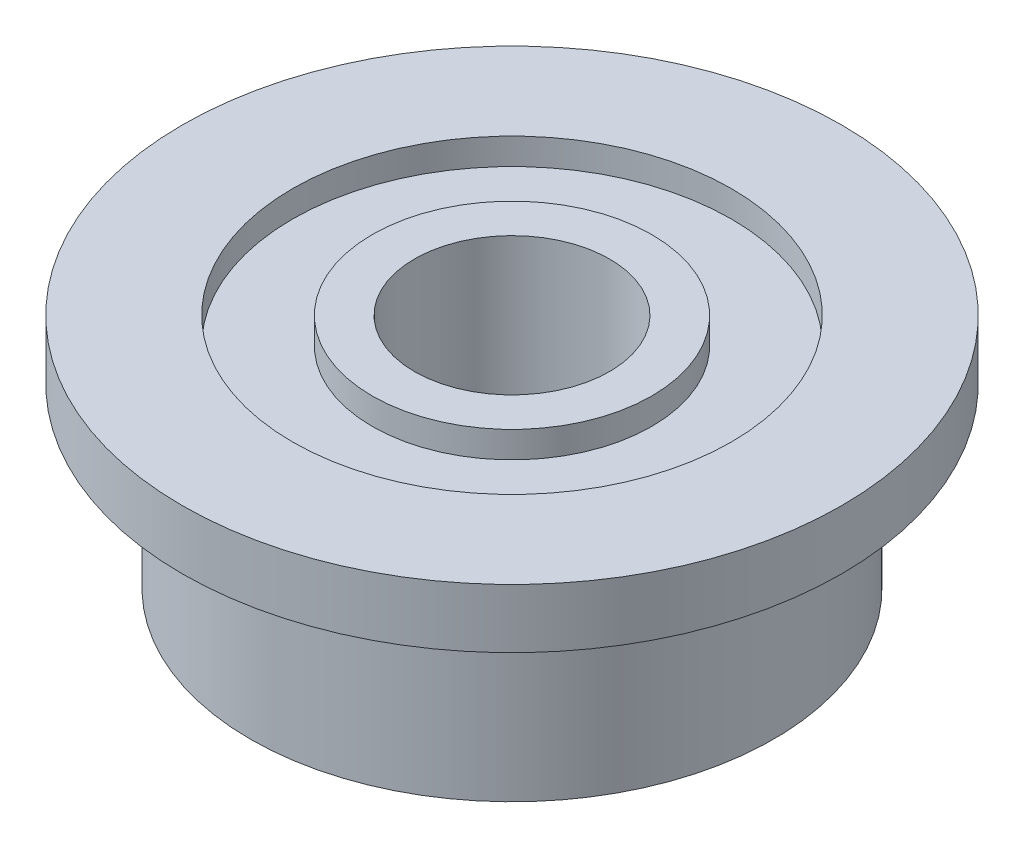
ISO-10303-21;
HEADER;
FILE_DESCRIPTION(('STEP AP214'),'2;1');
FILE_NAME('part.step','',(''),(''),'','','');
FILE_SCHEMA(('AUTOMOTIVE_DESIGN { 1 0 10303 214 1 1 1 1 }'));
ENDSEC;
DATA;
#1=APPLICATION_CONTEXT('core data for automotive mechanical design processes');
#2=APPLICATION_PROTOCOL_DEFINITION('international standard','automotive_design',2000,#1);
#3=PRODUCT_CONTEXT('',#1,'mechanical');
#4=PRODUCT('Part','Part','',(#3));
#5=PRODUCT_RELATED_PRODUCT_CATEGORY('part','',(#4));
#6=PRODUCT_DEFINITION_FORMATION('','',#4);
#7=PRODUCT_DEFINITION_CONTEXT('part definition',#1,'design');
#8=PRODUCT_DEFINITION('design','',#6,#7);
#9=PRODUCT_DEFINITION_SHAPE('','',#8);
#10=(LENGTH_UNIT() NAMED_UNIT(*) SI_UNIT(.MILLI.,.METRE.));
#11=(NAMED_UNIT(*) PLANE_ANGLE_UNIT() SI_UNIT($,.RADIAN.));
#12=(NAMED_UNIT(*) SI_UNIT($,.STERADIAN.) SOLID_ANGLE_UNIT());
#13=UNCERTAINTY_MEASURE_WITH_UNIT(LENGTH_MEASURE(1.E-05),#10,'distance_accuracy_value','');
#14=(GEOMETRIC_REPRESENTATION_CONTEXT(3) GLOBAL_UNCERTAINTY_ASSIGNED_CONTEXT((#13)) GLOBAL_UNIT_ASSIGNED_CONTEXT((#10,
#11,#12)) REPRESENTATION_CONTEXT('',''));
#15=CARTESIAN_POINT('',(0.,0.,0.));
#16=DIRECTION('',(0.,0.,1.));
#17=DIRECTION('',(1.,0.,0.));
#18=AXIS2_PLACEMENT_3D('',#15,#16,#17);
#19=CARTESIAN_POINT('',(0.,0.,0.));
#20=DIRECTION('',(0.,1.,0.));
#21=DIRECTION('',(0.,0.,1.));
#22=AXIS2_PLACEMENT_3D('',#19,#20,#21);
#23=CYLINDRICAL_SURFACE('',#22,1.325);
#24=CARTESIAN_POINT('',(0.,0.,0.));
#25=DIRECTION('',(0.,1.,0.));
#26=DIRECTION('',(0.,0.,1.));
#27=AXIS2_PLACEMENT_3D('',#24,#25,#26);
#28=CIRCLE('',#27,1.325);
#29=CARTESIAN_POINT('',(0.,0.,1.325));
#30=VERTEX_POINT('',#29);
#31=EDGE_CURVE('E10',#30,#30,#28,.T.);
#32=ORIENTED_EDGE('',*,*,#31,.F.);
#33=EDGE_LOOP('',(#32));
#34=FACE_BOUND('',#33,.T.);
#35=CARTESIAN_POINT('',(0.,-0.25,0.));
#36=DIRECTION('',(0.,1.,0.));
#37=DIRECTION('',(0.,0.,1.));
#38=AXIS2_PLACEMENT_3D('',#35,#36,#37);
#39=CIRCLE('',#38,1.325);
#40=CARTESIAN_POINT('',(0.,-0.25,1.325));
#41=VERTEX_POINT('',#40);
#42=EDGE_CURVE('E78',#41,#41,#39,.T.);
#43=ORIENTED_EDGE('',*,*,#42,.T.);
#44=EDGE_LOOP('',(#43));
#45=FACE_BOUND('',#44,.T.);
#46=ADVANCED_FACE('F32',(#34,#45),#23,.T.);
#47=CARTESIAN_POINT('',(1.325,0.,0.));
#48=DIRECTION('',(0.,-1.,0.));
#49=DIRECTION('',(0.,0.,-1.));
#50=AXIS2_PLACEMENT_3D('',#47,#48,#49);
#51=PLANE('',#50);
#52=CARTESIAN_POINT('',(0.,0.,0.));
#53=DIRECTION('',(0.,1.,0.));
#54=DIRECTION('',(0.,0.,1.));
#55=AXIS2_PLACEMENT_3D('',#52,#53,#54);
#56=CIRCLE('',#55,0.925);
#57=CARTESIAN_POINT('',(0.,0.,0.925));
#58=VERTEX_POINT('',#57);
#59=EDGE_CURVE('E38',#58,#58,#56,.T.);
#60=ORIENTED_EDGE('',*,*,#59,.F.);
#61=EDGE_LOOP('',(#60));
#62=FACE_BOUND('',#61,.T.);
#63=ORIENTED_EDGE('',*,*,#31,.T.);
#64=EDGE_LOOP('',(#63));
#65=FACE_BOUND('',#64,.T.);
#66=ADVANCED_FACE('F151',(#62,#65),#51,.F.);
#67=CARTESIAN_POINT('',(0.,0.,0.));
#68=DIRECTION('',(0.,1.,0.));
#69=DIRECTION('',(0.,0.,1.));
#70=AXIS2_PLACEMENT_3D('',#67,#68,#69);
#71=CYLINDRICAL_SURFACE('',#70,0.925);
#72=CARTESIAN_POINT('',(0.,-2.24,0.));
#73=DIRECTION('',(0.,1.,0.));
#74=DIRECTION('',(0.,0.,1.));
#75=AXIS2_PLACEMENT_3D('',#72,#73,#74);
#76=CIRCLE('',#75,0.925);
#77=CARTESIAN_POINT('',(0.,-2.24,0.925));
#78=VERTEX_POINT('',#77);
#79=EDGE_CURVE('E42',#78,#78,#76,.T.);
#80=ORIENTED_EDGE('',*,*,#79,.F.);
#81=EDGE_LOOP('',(#80));
#82=FACE_BOUND('',#81,.T.);
#83=ORIENTED_EDGE('',*,*,#59,.T.);
#84=EDGE_LOOP('',(#83));
#85=FACE_BOUND('',#84,.T.);
#86=ADVANCED_FACE('F146',(#82,#85),#71,.F.);
#87=CARTESIAN_POINT('',(0.925,-2.24,0.));
#88=DIRECTION('',(0.,1.,0.));
#89=DIRECTION('',(0.,0.,1.));
#90=AXIS2_PLACEMENT_3D('',#87,#88,#89);
#91=PLANE('',#90);
#92=CARTESIAN_POINT('',(0.,-2.24,0.));
#93=DIRECTION('',(0.,1.,0.));
#94=DIRECTION('',(0.,0.,1.));
#95=AXIS2_PLACEMENT_3D('',#92,#93,#94);
#96=CIRCLE('',#95,1.325);
#97=CARTESIAN_POINT('',(0.,-2.24,1.325));
#98=VERTEX_POINT('',#97);
#99=EDGE_CURVE('E46',#98,#98,#96,.T.);
#100=ORIENTED_EDGE('',*,*,#99,.F.);
#101=EDGE_LOOP('',(#100));
#102=FACE_BOUND('',#101,.T.);
#103=ORIENTED_EDGE('',*,*,#79,.T.);
#104=EDGE_LOOP('',(#103));
#105=FACE_BOUND('',#104,.T.);
#106=ADVANCED_FACE('F140',(#102,#105),#91,.F.);
#107=CARTESIAN_POINT('',(0.,0.,0.));
#108=DIRECTION('',(0.,1.,0.));
#109=DIRECTION('',(0.,0.,1.));
#110=AXIS2_PLACEMENT_3D('',#107,#108,#109);
#111=CYLINDRICAL_SURFACE('',#110,1.325);
#112=CARTESIAN_POINT('',(0.,-1.99,0.));
#113=DIRECTION('',(0.,1.,0.));
#114=DIRECTION('',(0.,0.,1.));
#115=AXIS2_PLACEMENT_3D('',#112,#113,#114);
#116=CIRCLE('',#115,1.325);
#117=CARTESIAN_POINT('',(0.,-1.99,1.325));
#118=VERTEX_POINT('',#117);
#119=EDGE_CURVE('E51',#118,#118,#116,.T.);
#120=ORIENTED_EDGE('',*,*,#119,.F.);
#121=EDGE_LOOP('',(#120));
#122=FACE_BOUND('',#121,.T.);
#123=ORIENTED_EDGE('',*,*,#99,.T.);
#124=EDGE_LOOP('',(#123));
#125=FACE_BOUND('',#124,.T.);
#126=ADVANCED_FACE('F134',(#122,#125),#111,.T.);
#127=CARTESIAN_POINT('',(1.325,-1.99,0.));
#128=DIRECTION('',(0.,1.,0.));
#129=DIRECTION('',(0.,0.,1.));
#130=AXIS2_PLACEMENT_3D('',#127,#128,#129);
#131=PLANE('',#130);
#132=CARTESIAN_POINT('',(0.,-1.99,0.));
#133=DIRECTION('',(0.,1.,0.));
#134=DIRECTION('',(0.,0.,1.));
#135=AXIS2_PLACEMENT_3D('',#132,#133,#134);
#136=CIRCLE('',#135,2.08);
#137=CARTESIAN_POINT('',(0.,-1.99,2.08));
#138=VERTEX_POINT('',#137);
#139=EDGE_CURVE('E54',#138,#138,#136,.T.);
#140=ORIENTED_EDGE('',*,*,#139,.F.);
#141=EDGE_LOOP('',(#140));
#142=FACE_BOUND('',#141,.T.);
#143=ORIENTED_EDGE('',*,*,#119,.T.);
#144=EDGE_LOOP('',(#143));
#145=FACE_BOUND('',#144,.T.);
#146=ADVANCED_FACE('F128',(#142,#145),#131,.F.);
#147=CARTESIAN_POINT('',(0.,0.,0.));
#148=DIRECTION('',(0.,1.,0.));
#149=DIRECTION('',(0.,0.,1.));
#150=AXIS2_PLACEMENT_3D('',#147,#148,#149);
#151=CYLINDRICAL_SURFACE('',#150,2.08);
#152=CARTESIAN_POINT('',(0.,-2.24,0.));
#153=DIRECTION('',(0.,1.,0.));
#154=DIRECTION('',(0.,0.,1.));
#155=AXIS2_PLACEMENT_3D('',#152,#153,#154);
#156=CIRCLE('',#155,2.08);
#157=CARTESIAN_POINT('',(0.,-2.24,2.08));
#158=VERTEX_POINT('',#157);
#159=EDGE_CURVE('E57',#158,#158,#156,.T.);
#160=ORIENTED_EDGE('',*,*,#159,.F.);
#161=EDGE_LOOP('',(#160));
#162=FACE_BOUND('',#161,.T.);
#163=ORIENTED_EDGE('',*,*,#139,.T.);
#164=EDGE_LOOP('',(#163));
#165=FACE_BOUND('',#164,.T.);
#166=ADVANCED_FACE('F122',(#162,#165),#151,.F.);
#167=CARTESIAN_POINT('',(2.08,-2.24,0.));
#168=DIRECTION('',(0.,1.,0.));
#169=DIRECTION('',(0.,0.,1.));
#170=AXIS2_PLACEMENT_3D('',#167,#168,#169);
#171=PLANE('',#170);
#172=CARTESIAN_POINT('',(0.,-2.24,0.));
#173=DIRECTION('',(0.,1.,0.));
#174=DIRECTION('',(0.,0.,1.));
#175=AXIS2_PLACEMENT_3D('',#172,#173,#174);
#176=CIRCLE('',#175,2.48);
#177=CARTESIAN_POINT('',(0.,-2.24,2.48));
#178=VERTEX_POINT('',#177);
#179=EDGE_CURVE('E60',#178,#178,#176,.T.);
#180=ORIENTED_EDGE('',*,*,#179,.F.);
#181=EDGE_LOOP('',(#180));
#182=FACE_BOUND('',#181,.T.);
#183=ORIENTED_EDGE('',*,*,#159,.T.);
#184=EDGE_LOOP('',(#183));
#185=FACE_BOUND('',#184,.T.);
#186=ADVANCED_FACE('F116',(#182,#185),#171,.F.);
#187=CARTESIAN_POINT('',(0.,0.,0.));
#188=DIRECTION('',(0.,1.,0.));
#189=DIRECTION('',(0.,0.,1.));
#190=AXIS2_PLACEMENT_3D('',#187,#188,#189);
#191=CYLINDRICAL_SURFACE('',#190,2.48);
#192=CARTESIAN_POINT('',(0.,-0.56,0.));
#193=DIRECTION('',(0.,1.,0.));
#194=DIRECTION('',(0.,0.,1.));
#195=AXIS2_PLACEMENT_3D('',#192,#193,#194);
#196=CIRCLE('',#195,2.48);
#197=CARTESIAN_POINT('',(0.,-0.56,2.48));
#198=VERTEX_POINT('',#197);
#199=EDGE_CURVE('E63',#198,#198,#196,.T.);
#200=ORIENTED_EDGE('',*,*,#199,.F.);
#201=EDGE_LOOP('',(#200));
#202=FACE_BOUND('',#201,.T.);
#203=ORIENTED_EDGE('',*,*,#179,.T.);
#204=EDGE_LOOP('',(#203));
#205=FACE_BOUND('',#204,.T.);
#206=ADVANCED_FACE('F110',(#202,#205),#191,.T.);
#207=CARTESIAN_POINT('',(2.48,-0.56,0.));
#208=DIRECTION('',(0.,1.,0.));
#209=DIRECTION('',(0.,0.,1.));
#210=AXIS2_PLACEMENT_3D('',#207,#208,#209);
#211=PLANE('',#210);
#212=CARTESIAN_POINT('',(0.,-0.56,0.));
#213=DIRECTION('',(0.,1.,0.));
#214=DIRECTION('',(0.,0.,1.));
#215=AXIS2_PLACEMENT_3D('',#212,#213,#214);
#216=CIRCLE('',#215,3.125);
#217=CARTESIAN_POINT('',(0.,-0.56,3.125));
#218=VERTEX_POINT('',#217);
#219=EDGE_CURVE('E66',#218,#218,#216,.T.);
#220=ORIENTED_EDGE('',*,*,#219,.F.);
#221=EDGE_LOOP('',(#220));
#222=FACE_BOUND('',#221,.T.);
#223=ORIENTED_EDGE('',*,*,#199,.T.);
#224=EDGE_LOOP('',(#223));
#225=FACE_BOUND('',#224,.T.);
#226=ADVANCED_FACE('F104',(#222,#225),#211,.F.);
#227=CARTESIAN_POINT('',(0.,0.,0.));
#228=DIRECTION('',(0.,1.,0.));
#229=DIRECTION('',(0.,0.,1.));
#230=AXIS2_PLACEMENT_3D('',#227,#228,#229);
#231=CYLINDRICAL_SURFACE('',#230,3.125);
#232=CARTESIAN_POINT('',(0.,0.,0.));
#233=DIRECTION('',(0.,1.,0.));
#234=DIRECTION('',(0.,0.,1.));
#235=AXIS2_PLACEMENT_3D('',#232,#233,#234);
#236=CIRCLE('',#235,3.125);
#237=CARTESIAN_POINT('',(0.,0.,3.125));
#238=VERTEX_POINT('',#237);
#239=EDGE_CURVE('E69',#238,#238,#236,.T.);
#240=ORIENTED_EDGE('',*,*,#239,.F.);
#241=EDGE_LOOP('',(#240));
#242=FACE_BOUND('',#241,.T.);
#243=ORIENTED_EDGE('',*,*,#219,.T.);
#244=EDGE_LOOP('',(#243));
#245=FACE_BOUND('',#244,.T.);
#246=ADVANCED_FACE('F98',(#242,#245),#231,.T.);
#247=CARTESIAN_POINT('',(3.125,0.,0.));
#248=DIRECTION('',(0.,-1.,0.));
#249=DIRECTION('',(0.,0.,-1.));
#250=AXIS2_PLACEMENT_3D('',#247,#248,#249);
#251=PLANE('',#250);
#252=CARTESIAN_POINT('',(0.,0.,0.));
#253=DIRECTION('',(0.,1.,0.));
#254=DIRECTION('',(0.,0.,1.));
#255=AXIS2_PLACEMENT_3D('',#252,#253,#254);
#256=CIRCLE('',#255,2.08);
#257=CARTESIAN_POINT('',(0.,0.,2.08));
#258=VERTEX_POINT('',#257);
#259=EDGE_CURVE('E72',#258,#258,#256,.T.);
#260=ORIENTED_EDGE('',*,*,#259,.F.);
#261=EDGE_LOOP('',(#260));
#262=FACE_BOUND('',#261,.T.);
#263=ORIENTED_EDGE('',*,*,#239,.T.);
#264=EDGE_LOOP('',(#263));
#265=FACE_BOUND('',#264,.T.);
#266=ADVANCED_FACE('F92',(#262,#265),#251,.F.);
#267=CARTESIAN_POINT('',(0.,0.,0.));
#268=DIRECTION('',(0.,1.,0.));
#269=DIRECTION('',(0.,0.,1.));
#270=AXIS2_PLACEMENT_3D('',#267,#268,#269);
#271=CYLINDRICAL_SURFACE('',#270,2.08);
#272=CARTESIAN_POINT('',(0.,-0.25,0.));
#273=DIRECTION('',(0.,1.,0.));
#274=DIRECTION('',(0.,0.,1.));
#275=AXIS2_PLACEMENT_3D('',#272,#273,#274);
#276=CIRCLE('',#275,2.08);
#277=CARTESIAN_POINT('',(0.,-0.25,2.08));
#278=VERTEX_POINT('',#277);
#279=EDGE_CURVE('E75',#278,#278,#276,.T.);
#280=ORIENTED_EDGE('',*,*,#279,.F.);
#281=EDGE_LOOP('',(#280));
#282=FACE_BOUND('',#281,.T.);
#283=ORIENTED_EDGE('',*,*,#259,.T.);
#284=EDGE_LOOP('',(#283));
#285=FACE_BOUND('',#284,.T.);
#286=ADVANCED_FACE('F86',(#282,#285),#271,.F.);
#287=CARTESIAN_POINT('',(2.08,-0.25,0.));
#288=DIRECTION('',(0.,-1.,0.));
#289=DIRECTION('',(0.,0.,-1.));
#290=AXIS2_PLACEMENT_3D('',#287,#288,#289);
#291=PLANE('',#290);
#292=ORIENTED_EDGE('',*,*,#42,.F.);
#293=EDGE_LOOP('',(#292));
#294=FACE_BOUND('',#293,.T.);
#295=ORIENTED_EDGE('',*,*,#279,.T.);
#296=EDGE_LOOP('',(#295));
#297=FACE_BOUND('',#296,.T.);
#298=ADVANCED_FACE('F83',(#294,#297),#291,.F.);
#299=CLOSED_SHELL('',(#46,#66,#86,#106,#126,#146,#166,#186,#206,#226,#246,#266,#286,#298));
#300=MANIFOLD_SOLID_BREP('B2',#299);
#301=ADVANCED_BREP_SHAPE_REPRESENTATION('',(#18,#300),#14);
#302=SHAPE_DEFINITION_REPRESENTATION(#9,#301);
ENDSEC;
END-ISO-10303-21;
